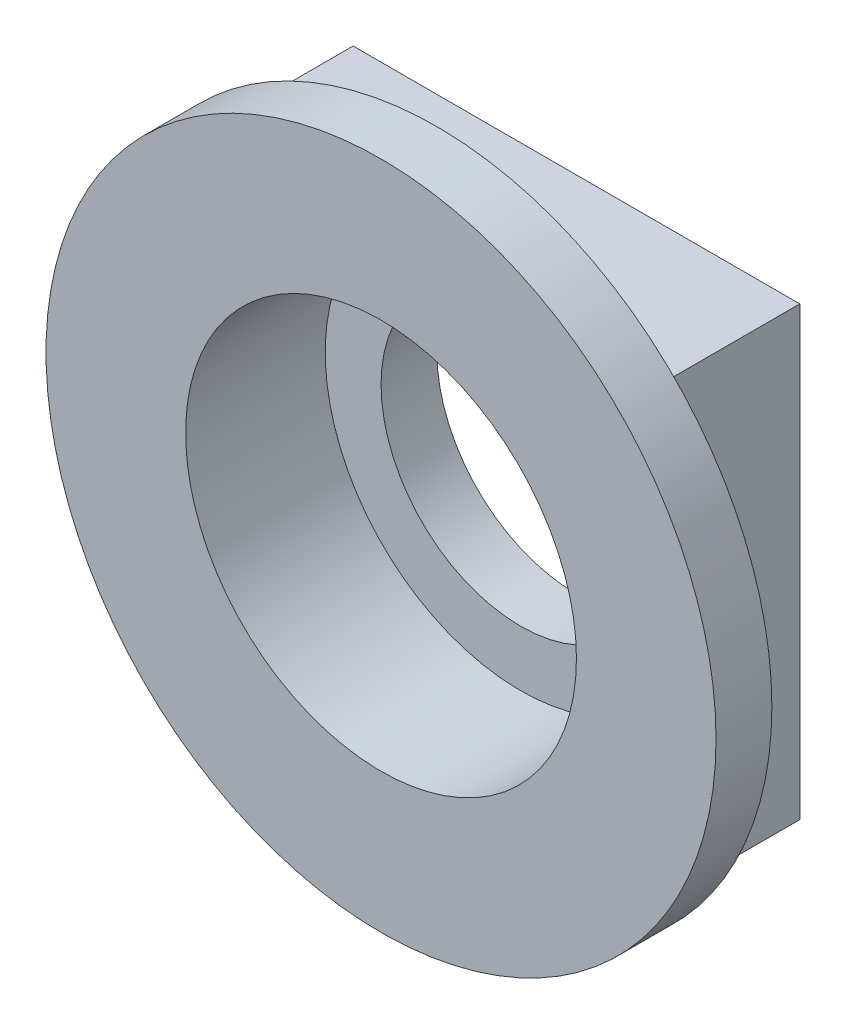
ISO-10303-21;
HEADER;
FILE_DESCRIPTION(('STEP AP214'),'2;1');
FILE_NAME('part.step','',(''),(''),'','','');
FILE_SCHEMA(('AUTOMOTIVE_DESIGN { 1 0 10303 214 1 1 1 1 }'));
ENDSEC;
DATA;
#1=APPLICATION_CONTEXT('core data for automotive mechanical design processes');
#2=APPLICATION_PROTOCOL_DEFINITION('international standard','automotive_design',2000,#1);
#3=PRODUCT_CONTEXT('',#1,'mechanical');
#4=PRODUCT('Part','Part','',(#3));
#5=PRODUCT_RELATED_PRODUCT_CATEGORY('part','',(#4));
#6=PRODUCT_DEFINITION_FORMATION('','',#4);
#7=PRODUCT_DEFINITION_CONTEXT('part definition',#1,'design');
#8=PRODUCT_DEFINITION('design','',#6,#7);
#9=PRODUCT_DEFINITION_SHAPE('','',#8);
#10=(LENGTH_UNIT() NAMED_UNIT(*) SI_UNIT(.MILLI.,.METRE.));
#11=(NAMED_UNIT(*) PLANE_ANGLE_UNIT() SI_UNIT($,.RADIAN.));
#12=(NAMED_UNIT(*) SI_UNIT($,.STERADIAN.) SOLID_ANGLE_UNIT());
#13=UNCERTAINTY_MEASURE_WITH_UNIT(LENGTH_MEASURE(1.E-05),#10,'distance_accuracy_value','');
#14=(GEOMETRIC_REPRESENTATION_CONTEXT(3) GLOBAL_UNCERTAINTY_ASSIGNED_CONTEXT((#13)) GLOBAL_UNIT_ASSIGNED_CONTEXT((#10,
#11,#12)) REPRESENTATION_CONTEXT('',''));
#15=CARTESIAN_POINT('',(0.,0.,0.));
#16=DIRECTION('',(0.,0.,1.));
#17=DIRECTION('',(1.,0.,0.));
#18=AXIS2_PLACEMENT_3D('',#15,#16,#17);
#19=CARTESIAN_POINT('',(0.,0.,-3.5));
#20=DIRECTION('',(0.,0.,1.));
#21=DIRECTION('',(1.,0.,0.));
#22=AXIS2_PLACEMENT_3D('',#19,#20,#21);
#23=CYLINDRICAL_SURFACE('',#22,6.);
#24=CARTESIAN_POINT('',(0.,0.,-1.));
#25=DIRECTION('',(0.,0.,1.));
#26=DIRECTION('',(1.,0.,0.));
#27=AXIS2_PLACEMENT_3D('',#24,#25,#26);
#28=CIRCLE('',#27,6.);
#29=CARTESIAN_POINT('',(6.,0.,-1.));
#30=VERTEX_POINT('',#29);
#31=EDGE_CURVE('E62',#30,#30,#28,.F.);
#32=ORIENTED_EDGE('',*,*,#31,.F.);
#33=EDGE_LOOP('',(#32));
#34=FACE_BOUND('',#33,.T.);
#35=CARTESIAN_POINT('',(0.,0.,0.));
#36=DIRECTION('',(0.,0.,1.));
#37=DIRECTION('',(1.,0.,0.));
#38=AXIS2_PLACEMENT_3D('',#35,#36,#37);
#39=CIRCLE('',#38,6.);
#40=CARTESIAN_POINT('',(6.,0.,0.));
#41=VERTEX_POINT('',#40);
#42=EDGE_CURVE('E13',#41,#41,#39,.T.);
#43=ORIENTED_EDGE('',*,*,#42,.F.);
#44=EDGE_LOOP('',(#43));
#45=FACE_BOUND('',#44,.T.);
#46=ADVANCED_FACE('F59',(#34,#45),#23,.T.);
#47=CARTESIAN_POINT('',(0.,0.,-3.5));
#48=DIRECTION('',(0.,0.,1.));
#49=DIRECTION('',(1.,0.,0.));
#50=AXIS2_PLACEMENT_3D('',#47,#48,#49);
#51=PLANE('',#50);
#52=DIRECTION('',(0.,-1.,0.));
#53=VECTOR('',#52,1.);
#54=CARTESIAN_POINT('',(-4.,4.,-3.5));
#55=LINE('',#54,#53);
#56=CARTESIAN_POINT('',(-4.,4.,-3.5));
#57=VERTEX_POINT('',#56);
#58=CARTESIAN_POINT('',(-4.,-4.,-3.5));
#59=VERTEX_POINT('',#58);
#60=EDGE_CURVE('E120',#57,#59,#55,.T.);
#61=ORIENTED_EDGE('',*,*,#60,.F.);
#62=DIRECTION('',(1.,0.,0.));
#63=VECTOR('',#62,1.);
#64=CARTESIAN_POINT('',(-4.,4.,-3.5));
#65=LINE('',#64,#63);
#66=CARTESIAN_POINT('',(4.,4.,-3.5));
#67=VERTEX_POINT('',#66);
#68=EDGE_CURVE('E75',#57,#67,#65,.T.);
#69=ORIENTED_EDGE('',*,*,#68,.T.);
#70=DIRECTION('',(0.,-1.,0.));
#71=VECTOR('',#70,1.);
#72=CARTESIAN_POINT('',(4.,4.,-3.5));
#73=LINE('',#72,#71);
#74=CARTESIAN_POINT('',(4.,-4.,-3.5));
#75=VERTEX_POINT('',#74);
#76=EDGE_CURVE('E111',#67,#75,#73,.T.);
#77=ORIENTED_EDGE('',*,*,#76,.T.);
#78=DIRECTION('',(1.,0.,0.));
#79=VECTOR('',#78,1.);
#80=CARTESIAN_POINT('',(-4.,-4.,-3.5));
#81=LINE('',#80,#79);
#82=EDGE_CURVE('E115',#59,#75,#81,.T.);
#83=ORIENTED_EDGE('',*,*,#82,.F.);
#84=EDGE_LOOP('',(#61,#69,#77,#83));
#85=FACE_BOUND('',#84,.T.);
#86=CARTESIAN_POINT('',(0.,0.,-3.5));
#87=DIRECTION('',(0.,0.,1.));
#88=DIRECTION('',(1.,0.,0.));
#89=AXIS2_PLACEMENT_3D('',#86,#87,#88);
#90=CIRCLE('',#89,2.5);
#91=CARTESIAN_POINT('',(2.5,0.,-3.5));
#92=VERTEX_POINT('',#91);
#93=EDGE_CURVE('E138',#92,#92,#90,.T.);
#94=ORIENTED_EDGE('',*,*,#93,.T.);
#95=EDGE_LOOP('',(#94));
#96=FACE_BOUND('',#95,.T.);
#97=ADVANCED_FACE('F118',(#85,#96),#51,.F.);
#98=CARTESIAN_POINT('',(0.,0.,0.));
#99=DIRECTION('',(0.,0.,1.));
#100=DIRECTION('',(1.,0.,0.));
#101=AXIS2_PLACEMENT_3D('',#98,#99,#100);
#102=PLANE('',#101);
#103=CARTESIAN_POINT('',(0.,0.,0.));
#104=DIRECTION('',(0.,0.,1.));
#105=DIRECTION('',(1.,0.,0.));
#106=AXIS2_PLACEMENT_3D('',#103,#104,#105);
#107=CIRCLE('',#106,3.5);
#108=CARTESIAN_POINT('',(3.5,0.,0.));
#109=VERTEX_POINT('',#108);
#110=EDGE_CURVE('E144',#109,#109,#107,.T.);
#111=ORIENTED_EDGE('',*,*,#110,.F.);
#112=EDGE_LOOP('',(#111));
#113=FACE_BOUND('',#112,.T.);
#114=ORIENTED_EDGE('',*,*,#42,.T.);
#115=EDGE_LOOP('',(#114));
#116=FACE_BOUND('',#115,.T.);
#117=ADVANCED_FACE('F161',(#113,#116),#102,.T.);
#118=CARTESIAN_POINT('',(0.,0.,-2.5));
#119=DIRECTION('',(0.,0.,1.));
#120=DIRECTION('',(1.,0.,0.));
#121=AXIS2_PLACEMENT_3D('',#118,#119,#120);
#122=CYLINDRICAL_SURFACE('',#121,3.5);
#123=CARTESIAN_POINT('',(0.,0.,-2.5));
#124=DIRECTION('',(0.,0.,1.));
#125=DIRECTION('',(1.,0.,0.));
#126=AXIS2_PLACEMENT_3D('',#123,#124,#125);
#127=CIRCLE('',#126,3.5);
#128=CARTESIAN_POINT('',(3.5,0.,-2.5));
#129=VERTEX_POINT('',#128);
#130=EDGE_CURVE('E67',#129,#129,#127,.T.);
#131=ORIENTED_EDGE('',*,*,#130,.F.);
#132=EDGE_LOOP('',(#131));
#133=FACE_BOUND('',#132,.T.);
#134=ORIENTED_EDGE('',*,*,#110,.T.);
#135=EDGE_LOOP('',(#134));
#136=FACE_BOUND('',#135,.T.);
#137=ADVANCED_FACE('F155',(#133,#136),#122,.F.);
#138=CARTESIAN_POINT('',(0.,0.,-2.5));
#139=DIRECTION('',(0.,0.,1.));
#140=DIRECTION('',(1.,0.,0.));
#141=AXIS2_PLACEMENT_3D('',#138,#139,#140);
#142=PLANE('',#141);
#143=CARTESIAN_POINT('',(0.,0.,-2.5));
#144=DIRECTION('',(0.,0.,1.));
#145=DIRECTION('',(1.,0.,0.));
#146=AXIS2_PLACEMENT_3D('',#143,#144,#145);
#147=CIRCLE('',#146,2.5);
#148=CARTESIAN_POINT('',(2.5,0.,-2.5));
#149=VERTEX_POINT('',#148);
#150=EDGE_CURVE('E141',#149,#149,#147,.T.);
#151=ORIENTED_EDGE('',*,*,#150,.F.);
#152=EDGE_LOOP('',(#151));
#153=FACE_BOUND('',#152,.T.);
#154=ORIENTED_EDGE('',*,*,#130,.T.);
#155=EDGE_LOOP('',(#154));
#156=FACE_BOUND('',#155,.T.);
#157=ADVANCED_FACE('F152',(#153,#156),#142,.T.);
#158=CARTESIAN_POINT('',(0.,0.,-3.5));
#159=DIRECTION('',(0.,0.,1.));
#160=DIRECTION('',(1.,0.,0.));
#161=AXIS2_PLACEMENT_3D('',#158,#159,#160);
#162=CYLINDRICAL_SURFACE('',#161,2.5);
#163=ORIENTED_EDGE('',*,*,#150,.T.);
#164=EDGE_LOOP('',(#163));
#165=FACE_BOUND('',#164,.T.);
#166=ORIENTED_EDGE('',*,*,#93,.F.);
#167=EDGE_LOOP('',(#166));
#168=FACE_BOUND('',#167,.T.);
#169=ADVANCED_FACE('F149',(#165,#168),#162,.F.);
#170=CARTESIAN_POINT('',(0.,0.,-1.));
#171=DIRECTION('',(0.,0.,1.));
#172=DIRECTION('',(1.,0.,0.));
#173=AXIS2_PLACEMENT_3D('',#170,#171,#172);
#174=PLANE('',#173);
#175=ORIENTED_EDGE('',*,*,#31,.T.);
#176=EDGE_LOOP('',(#175));
#177=FACE_BOUND('',#176,.T.);
#178=DIRECTION('',(0.,-1.,0.));
#179=VECTOR('',#178,1.);
#180=CARTESIAN_POINT('',(-4.,4.,-1.));
#181=LINE('',#180,#179);
#182=CARTESIAN_POINT('',(-4.,4.,-1.));
#183=VERTEX_POINT('',#182);
#184=CARTESIAN_POINT('',(-4.,-4.,-1.));
#185=VERTEX_POINT('',#184);
#186=EDGE_CURVE('E121',#183,#185,#181,.T.);
#187=ORIENTED_EDGE('',*,*,#186,.T.);
#188=DIRECTION('',(1.,0.,0.));
#189=VECTOR('',#188,1.);
#190=CARTESIAN_POINT('',(-4.,-4.,-1.));
#191=LINE('',#190,#189);
#192=CARTESIAN_POINT('',(4.,-4.,-1.));
#193=VERTEX_POINT('',#192);
#194=EDGE_CURVE('E124',#185,#193,#191,.T.);
#195=ORIENTED_EDGE('',*,*,#194,.T.);
#196=DIRECTION('',(0.,-1.,0.));
#197=VECTOR('',#196,1.);
#198=CARTESIAN_POINT('',(4.,4.,-1.));
#199=LINE('',#198,#197);
#200=CARTESIAN_POINT('',(4.,4.,-1.));
#201=VERTEX_POINT('',#200);
#202=EDGE_CURVE('E131',#201,#193,#199,.T.);
#203=ORIENTED_EDGE('',*,*,#202,.F.);
#204=DIRECTION('',(1.,0.,0.));
#205=VECTOR('',#204,1.);
#206=CARTESIAN_POINT('',(-4.,4.,-1.));
#207=LINE('',#206,#205);
#208=EDGE_CURVE('E105',#183,#201,#207,.T.);
#209=ORIENTED_EDGE('',*,*,#208,.F.);
#210=EDGE_LOOP('',(#187,#195,#203,#209));
#211=FACE_BOUND('',#210,.T.);
#212=ADVANCED_FACE('F178',(#177,#211),#174,.F.);
#213=CARTESIAN_POINT('',(-4.,4.,-3.5));
#214=DIRECTION('',(0.,-1.,0.));
#215=DIRECTION('',(0.,0.,-1.));
#216=AXIS2_PLACEMENT_3D('',#213,#214,#215);
#217=PLANE('',#216);
#218=ORIENTED_EDGE('',*,*,#208,.T.);
#219=DIRECTION('',(0.,0.,1.));
#220=VECTOR('',#219,1.);
#221=CARTESIAN_POINT('',(4.,4.,-3.5));
#222=LINE('',#221,#220);
#223=EDGE_CURVE('E102',#67,#201,#222,.T.);
#224=ORIENTED_EDGE('',*,*,#223,.F.);
#225=ORIENTED_EDGE('',*,*,#68,.F.);
#226=DIRECTION('',(0.,0.,1.));
#227=VECTOR('',#226,1.);
#228=CARTESIAN_POINT('',(-4.,4.,-3.5));
#229=LINE('',#228,#227);
#230=EDGE_CURVE('E129',#57,#183,#229,.T.);
#231=ORIENTED_EDGE('',*,*,#230,.T.);
#232=EDGE_LOOP('',(#218,#224,#225,#231));
#233=FACE_BOUND('',#232,.T.);
#234=ADVANCED_FACE('F104',(#233),#217,.F.);
#235=CARTESIAN_POINT('',(4.,4.,-3.5));
#236=DIRECTION('',(-1.,0.,0.));
#237=DIRECTION('',(0.,0.,1.));
#238=AXIS2_PLACEMENT_3D('',#235,#236,#237);
#239=PLANE('',#238);
#240=ORIENTED_EDGE('',*,*,#202,.T.);
#241=DIRECTION('',(0.,0.,1.));
#242=VECTOR('',#241,1.);
#243=CARTESIAN_POINT('',(4.,-4.,-3.5));
#244=LINE('',#243,#242);
#245=EDGE_CURVE('E108',#75,#193,#244,.T.);
#246=ORIENTED_EDGE('',*,*,#245,.F.);
#247=ORIENTED_EDGE('',*,*,#76,.F.);
#248=ORIENTED_EDGE('',*,*,#223,.T.);
#249=EDGE_LOOP('',(#240,#246,#247,#248));
#250=FACE_BOUND('',#249,.T.);
#251=ADVANCED_FACE('F112',(#250),#239,.F.);
#252=CARTESIAN_POINT('',(-4.,-4.,-3.5));
#253=DIRECTION('',(0.,-1.,0.));
#254=DIRECTION('',(0.,0.,-1.));
#255=AXIS2_PLACEMENT_3D('',#252,#253,#254);
#256=PLANE('',#255);
#257=ORIENTED_EDGE('',*,*,#194,.F.);
#258=DIRECTION('',(0.,0.,1.));
#259=VECTOR('',#258,1.);
#260=CARTESIAN_POINT('',(-4.,-4.,-3.5));
#261=LINE('',#260,#259);
#262=EDGE_CURVE('E83',#59,#185,#261,.T.);
#263=ORIENTED_EDGE('',*,*,#262,.F.);
#264=ORIENTED_EDGE('',*,*,#82,.T.);
#265=ORIENTED_EDGE('',*,*,#245,.T.);
#266=EDGE_LOOP('',(#257,#263,#264,#265));
#267=FACE_BOUND('',#266,.T.);
#268=ADVANCED_FACE('F184',(#267),#256,.T.);
#269=CARTESIAN_POINT('',(-4.,4.,-3.5));
#270=DIRECTION('',(-1.,0.,0.));
#271=DIRECTION('',(0.,0.,1.));
#272=AXIS2_PLACEMENT_3D('',#269,#270,#271);
#273=PLANE('',#272);
#274=ORIENTED_EDGE('',*,*,#186,.F.);
#275=ORIENTED_EDGE('',*,*,#230,.F.);
#276=ORIENTED_EDGE('',*,*,#60,.T.);
#277=ORIENTED_EDGE('',*,*,#262,.T.);
#278=EDGE_LOOP('',(#274,#275,#276,#277));
#279=FACE_BOUND('',#278,.T.);
#280=ADVANCED_FACE('F186',(#279),#273,.T.);
#281=CLOSED_SHELL('',(#46,#97,#117,#137,#157,#169,#212,#234,#251,#268,#280));
#282=MANIFOLD_SOLID_BREP('B2',#281);
#283=ADVANCED_BREP_SHAPE_REPRESENTATION('',(#18,#282),#14);
#284=SHAPE_DEFINITION_REPRESENTATION(#9,#283);
ENDSEC;
END-ISO-10303-21;
